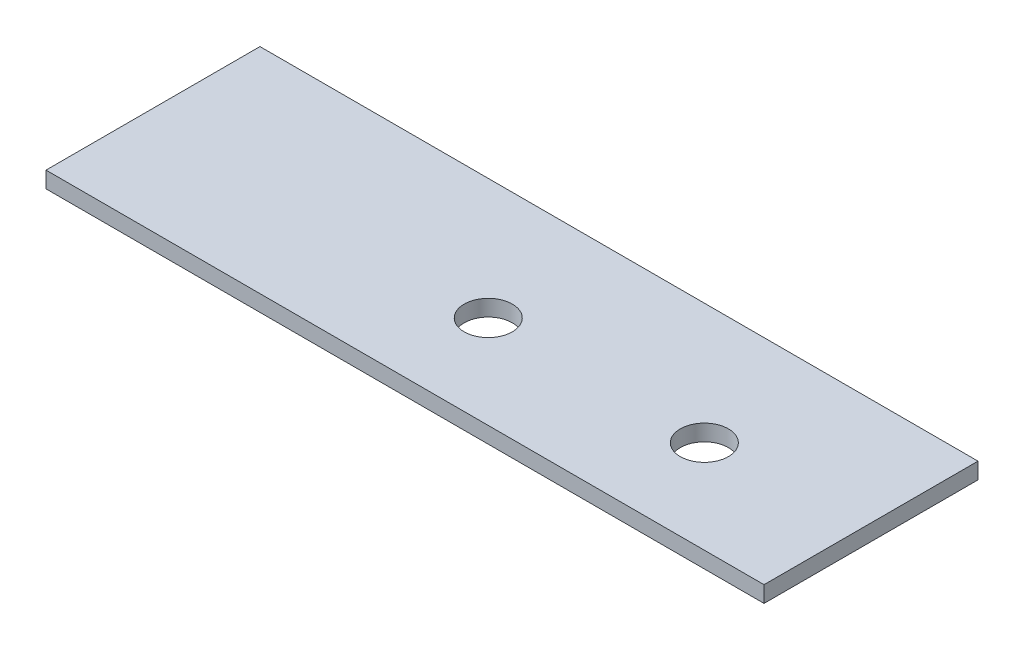
ISO-10303-21;
HEADER;
FILE_DESCRIPTION(('STEP AP214'),'2;1');
FILE_NAME('part.step','',(''),(''),'','','');
FILE_SCHEMA(('AUTOMOTIVE_DESIGN { 1 0 10303 214 1 1 1 1 }'));
ENDSEC;
DATA;
#1=APPLICATION_CONTEXT('core data for automotive mechanical design processes');
#2=APPLICATION_PROTOCOL_DEFINITION('international standard','automotive_design',2000,#1);
#3=PRODUCT_CONTEXT('',#1,'mechanical');
#4=PRODUCT('Part','Part','',(#3));
#5=PRODUCT_RELATED_PRODUCT_CATEGORY('part','',(#4));
#6=PRODUCT_DEFINITION_FORMATION('','',#4);
#7=PRODUCT_DEFINITION_CONTEXT('part definition',#1,'design');
#8=PRODUCT_DEFINITION('design','',#6,#7);
#9=PRODUCT_DEFINITION_SHAPE('','',#8);
#10=(LENGTH_UNIT() NAMED_UNIT(*) SI_UNIT(.MILLI.,.METRE.));
#11=(NAMED_UNIT(*) PLANE_ANGLE_UNIT() SI_UNIT($,.RADIAN.));
#12=(NAMED_UNIT(*) SI_UNIT($,.STERADIAN.) SOLID_ANGLE_UNIT());
#13=UNCERTAINTY_MEASURE_WITH_UNIT(LENGTH_MEASURE(1.E-05),#10,'distance_accuracy_value','');
#14=(GEOMETRIC_REPRESENTATION_CONTEXT(3) GLOBAL_UNCERTAINTY_ASSIGNED_CONTEXT((#13)) GLOBAL_UNIT_ASSIGNED_CONTEXT((#10,
#11,#12)) REPRESENTATION_CONTEXT('',''));
#15=CARTESIAN_POINT('',(0.,0.,0.));
#16=DIRECTION('',(0.,0.,1.));
#17=DIRECTION('',(1.,0.,0.));
#18=AXIS2_PLACEMENT_3D('',#15,#16,#17);
#19=CARTESIAN_POINT('',(16.78,0.38,4.99999999999999));
#20=DIRECTION('',(0.,1.,0.));
#21=DIRECTION('',(0.,0.,1.));
#22=AXIS2_PLACEMENT_3D('',#19,#20,#21);
#23=PLANE('',#22);
#24=CARTESIAN_POINT('',(-0.460000000000013,0.38,0.65));
#25=DIRECTION('',(0.,1.,0.));
#26=DIRECTION('',(0.,0.,1.));
#27=AXIS2_PLACEMENT_3D('',#24,#25,#26);
#28=CIRCLE('',#27,1.125);
#29=CARTESIAN_POINT('',(-0.460000000000013,0.38,1.775));
#30=VERTEX_POINT('',#29);
#31=EDGE_CURVE('E100',#30,#30,#28,.T.);
#32=ORIENTED_EDGE('',*,*,#31,.F.);
#33=EDGE_LOOP('',(#32));
#34=FACE_BOUND('',#33,.T.);
#35=DIRECTION('',(0.,0.,-1.));
#36=VECTOR('',#35,1.);
#37=CARTESIAN_POINT('',(16.78,0.38,-5.00000000000001));
#38=LINE('',#37,#36);
#39=CARTESIAN_POINT('',(16.78,0.38,4.99999999999999));
#40=VERTEX_POINT('',#39);
#41=CARTESIAN_POINT('',(16.78,0.38,-5.00000000000001));
#42=VERTEX_POINT('',#41);
#43=EDGE_CURVE('E85',#40,#42,#38,.T.);
#44=ORIENTED_EDGE('',*,*,#43,.T.);
#45=DIRECTION('',(-1.,0.,0.));
#46=VECTOR('',#45,1.);
#47=CARTESIAN_POINT('',(-16.78,0.38,-5.00000000000001));
#48=LINE('',#47,#46);
#49=CARTESIAN_POINT('',(-16.78,0.38,-5.00000000000001));
#50=VERTEX_POINT('',#49);
#51=EDGE_CURVE('E80',#42,#50,#48,.T.);
#52=ORIENTED_EDGE('',*,*,#51,.T.);
#53=DIRECTION('',(0.,0.,1.));
#54=VECTOR('',#53,1.);
#55=CARTESIAN_POINT('',(-16.78,0.38,-5.00000000000001));
#56=LINE('',#55,#54);
#57=CARTESIAN_POINT('',(-16.78,0.38,4.99999999999999));
#58=VERTEX_POINT('',#57);
#59=EDGE_CURVE('E83',#50,#58,#56,.T.);
#60=ORIENTED_EDGE('',*,*,#59,.T.);
#61=DIRECTION('',(1.,0.,0.));
#62=VECTOR('',#61,1.);
#63=CARTESIAN_POINT('',(-16.78,0.38,4.99999999999999));
#64=LINE('',#63,#62);
#65=EDGE_CURVE('E50',#58,#40,#64,.T.);
#66=ORIENTED_EDGE('',*,*,#65,.T.);
#67=EDGE_LOOP('',(#44,#52,#60,#66));
#68=FACE_BOUND('',#67,.T.);
#69=CARTESIAN_POINT('',(9.63999999999999,0.38,0.65));
#70=DIRECTION('',(0.,1.,0.));
#71=DIRECTION('',(0.,0.,1.));
#72=AXIS2_PLACEMENT_3D('',#69,#70,#71);
#73=CIRCLE('',#72,1.125);
#74=CARTESIAN_POINT('',(9.63999999999999,0.38,1.775));
#75=VERTEX_POINT('',#74);
#76=EDGE_CURVE('E115',#75,#75,#73,.T.);
#77=ORIENTED_EDGE('',*,*,#76,.F.);
#78=EDGE_LOOP('',(#77));
#79=FACE_BOUND('',#78,.T.);
#80=ADVANCED_FACE('F33',(#34,#68,#79),#23,.T.);
#81=CARTESIAN_POINT('',(16.78,-0.38,4.99999999999999));
#82=DIRECTION('',(0.,1.,0.));
#83=DIRECTION('',(0.,0.,1.));
#84=AXIS2_PLACEMENT_3D('',#81,#82,#83);
#85=PLANE('',#84);
#86=CARTESIAN_POINT('',(-0.460000000000013,-0.38,0.65));
#87=DIRECTION('',(0.,1.,0.));
#88=DIRECTION('',(0.,0.,1.));
#89=AXIS2_PLACEMENT_3D('',#86,#87,#88);
#90=CIRCLE('',#89,1.125);
#91=CARTESIAN_POINT('',(-0.460000000000013,-0.38,1.775));
#92=VERTEX_POINT('',#91);
#93=EDGE_CURVE('E112',#92,#92,#90,.T.);
#94=ORIENTED_EDGE('',*,*,#93,.T.);
#95=EDGE_LOOP('',(#94));
#96=FACE_BOUND('',#95,.T.);
#97=DIRECTION('',(0.,0.,-1.));
#98=VECTOR('',#97,1.);
#99=CARTESIAN_POINT('',(16.78,-0.38,-5.00000000000001));
#100=LINE('',#99,#98);
#101=CARTESIAN_POINT('',(16.78,-0.38,4.99999999999999));
#102=VERTEX_POINT('',#101);
#103=CARTESIAN_POINT('',(16.78,-0.38,-5.00000000000001));
#104=VERTEX_POINT('',#103);
#105=EDGE_CURVE('E97',#102,#104,#100,.T.);
#106=ORIENTED_EDGE('',*,*,#105,.F.);
#107=DIRECTION('',(1.,0.,0.));
#108=VECTOR('',#107,1.);
#109=CARTESIAN_POINT('',(-16.78,-0.38,4.99999999999999));
#110=LINE('',#109,#108);
#111=CARTESIAN_POINT('',(-16.78,-0.38,4.99999999999999));
#112=VERTEX_POINT('',#111);
#113=EDGE_CURVE('E73',#112,#102,#110,.T.);
#114=ORIENTED_EDGE('',*,*,#113,.F.);
#115=DIRECTION('',(0.,0.,1.));
#116=VECTOR('',#115,1.);
#117=CARTESIAN_POINT('',(-16.78,-0.38,-5.00000000000001));
#118=LINE('',#117,#116);
#119=CARTESIAN_POINT('',(-16.78,-0.38,-5.00000000000001));
#120=VERTEX_POINT('',#119);
#121=EDGE_CURVE('E67',#120,#112,#118,.T.);
#122=ORIENTED_EDGE('',*,*,#121,.F.);
#123=DIRECTION('',(-1.,0.,0.));
#124=VECTOR('',#123,1.);
#125=CARTESIAN_POINT('',(-16.78,-0.38,-5.00000000000001));
#126=LINE('',#125,#124);
#127=EDGE_CURVE('E89',#104,#120,#126,.T.);
#128=ORIENTED_EDGE('',*,*,#127,.F.);
#129=EDGE_LOOP('',(#106,#114,#122,#128));
#130=FACE_BOUND('',#129,.T.);
#131=CARTESIAN_POINT('',(9.63999999999999,-0.38,0.65));
#132=DIRECTION('',(0.,1.,0.));
#133=DIRECTION('',(0.,0.,1.));
#134=AXIS2_PLACEMENT_3D('',#131,#132,#133);
#135=CIRCLE('',#134,1.125);
#136=CARTESIAN_POINT('',(9.63999999999999,-0.38,1.775));
#137=VERTEX_POINT('',#136);
#138=EDGE_CURVE('E118',#137,#137,#135,.T.);
#139=ORIENTED_EDGE('',*,*,#138,.T.);
#140=EDGE_LOOP('',(#139));
#141=FACE_BOUND('',#140,.T.);
#142=ADVANCED_FACE('F108',(#96,#130,#141),#85,.F.);
#143=CARTESIAN_POINT('',(16.78,0.38,-5.00000000000001));
#144=DIRECTION('',(-1.,0.,0.));
#145=DIRECTION('',(0.,0.,1.));
#146=AXIS2_PLACEMENT_3D('',#143,#144,#145);
#147=PLANE('',#146);
#148=ORIENTED_EDGE('',*,*,#105,.T.);
#149=DIRECTION('',(0.,-1.,0.));
#150=VECTOR('',#149,1.);
#151=CARTESIAN_POINT('',(16.78,0.38,-5.00000000000001));
#152=LINE('',#151,#150);
#153=EDGE_CURVE('E11',#42,#104,#152,.T.);
#154=ORIENTED_EDGE('',*,*,#153,.F.);
#155=ORIENTED_EDGE('',*,*,#43,.F.);
#156=DIRECTION('',(0.,-1.,0.));
#157=VECTOR('',#156,1.);
#158=CARTESIAN_POINT('',(16.78,0.38,4.99999999999999));
#159=LINE('',#158,#157);
#160=EDGE_CURVE('E93',#40,#102,#159,.T.);
#161=ORIENTED_EDGE('',*,*,#160,.T.);
#162=EDGE_LOOP('',(#148,#154,#155,#161));
#163=FACE_BOUND('',#162,.T.);
#164=ADVANCED_FACE('F35',(#163),#147,.F.);
#165=CARTESIAN_POINT('',(-16.78,0.38,-5.00000000000001));
#166=DIRECTION('',(0.,0.,1.));
#167=DIRECTION('',(1.,0.,0.));
#168=AXIS2_PLACEMENT_3D('',#165,#166,#167);
#169=PLANE('',#168);
#170=ORIENTED_EDGE('',*,*,#127,.T.);
#171=DIRECTION('',(0.,-1.,0.));
#172=VECTOR('',#171,1.);
#173=CARTESIAN_POINT('',(-16.78,0.38,-5.00000000000001));
#174=LINE('',#173,#172);
#175=EDGE_CURVE('E42',#50,#120,#174,.T.);
#176=ORIENTED_EDGE('',*,*,#175,.F.);
#177=ORIENTED_EDGE('',*,*,#51,.F.);
#178=ORIENTED_EDGE('',*,*,#153,.T.);
#179=EDGE_LOOP('',(#170,#176,#177,#178));
#180=FACE_BOUND('',#179,.T.);
#181=ADVANCED_FACE('F88',(#180),#169,.F.);
#182=CARTESIAN_POINT('',(-16.78,0.38,-5.00000000000001));
#183=DIRECTION('',(1.,0.,0.));
#184=DIRECTION('',(0.,0.,-1.));
#185=AXIS2_PLACEMENT_3D('',#182,#183,#184);
#186=PLANE('',#185);
#187=ORIENTED_EDGE('',*,*,#121,.T.);
#188=DIRECTION('',(0.,-1.,0.));
#189=VECTOR('',#188,1.);
#190=CARTESIAN_POINT('',(-16.78,0.38,4.99999999999999));
#191=LINE('',#190,#189);
#192=EDGE_CURVE('E90',#58,#112,#191,.T.);
#193=ORIENTED_EDGE('',*,*,#192,.F.);
#194=ORIENTED_EDGE('',*,*,#59,.F.);
#195=ORIENTED_EDGE('',*,*,#175,.T.);
#196=EDGE_LOOP('',(#187,#193,#194,#195));
#197=FACE_BOUND('',#196,.T.);
#198=ADVANCED_FACE('F91',(#197),#186,.F.);
#199=CARTESIAN_POINT('',(-16.78,0.38,4.99999999999999));
#200=DIRECTION('',(0.,0.,-1.));
#201=DIRECTION('',(-1.,0.,0.));
#202=AXIS2_PLACEMENT_3D('',#199,#200,#201);
#203=PLANE('',#202);
#204=ORIENTED_EDGE('',*,*,#113,.T.);
#205=ORIENTED_EDGE('',*,*,#160,.F.);
#206=ORIENTED_EDGE('',*,*,#65,.F.);
#207=ORIENTED_EDGE('',*,*,#192,.T.);
#208=EDGE_LOOP('',(#204,#205,#206,#207));
#209=FACE_BOUND('',#208,.T.);
#210=ADVANCED_FACE('F105',(#209),#203,.F.);
#211=CARTESIAN_POINT('',(-0.460000000000013,0.38,0.65));
#212=DIRECTION('',(0.,-1.,0.));
#213=DIRECTION('',(0.,0.,-1.));
#214=AXIS2_PLACEMENT_3D('',#211,#212,#213);
#215=CYLINDRICAL_SURFACE('',#214,1.125);
#216=ORIENTED_EDGE('',*,*,#31,.T.);
#217=EDGE_LOOP('',(#216));
#218=FACE_BOUND('',#217,.T.);
#219=ORIENTED_EDGE('',*,*,#93,.F.);
#220=EDGE_LOOP('',(#219));
#221=FACE_BOUND('',#220,.T.);
#222=ADVANCED_FACE('F136',(#218,#221),#215,.F.);
#223=CARTESIAN_POINT('',(9.63999999999999,0.38,0.65));
#224=DIRECTION('',(0.,-1.,0.));
#225=DIRECTION('',(0.,0.,-1.));
#226=AXIS2_PLACEMENT_3D('',#223,#224,#225);
#227=CYLINDRICAL_SURFACE('',#226,1.125);
#228=ORIENTED_EDGE('',*,*,#76,.T.);
#229=EDGE_LOOP('',(#228));
#230=FACE_BOUND('',#229,.T.);
#231=ORIENTED_EDGE('',*,*,#138,.F.);
#232=EDGE_LOOP('',(#231));
#233=FACE_BOUND('',#232,.T.);
#234=ADVANCED_FACE('F124',(#230,#233),#227,.F.);
#235=CLOSED_SHELL('',(#80,#142,#164,#181,#198,#210,#222,#234));
#236=MANIFOLD_SOLID_BREP('B2',#235);
#237=ADVANCED_BREP_SHAPE_REPRESENTATION('',(#18,#236),#14);
#238=SHAPE_DEFINITION_REPRESENTATION(#9,#237);
ENDSEC;
END-ISO-10303-21;
